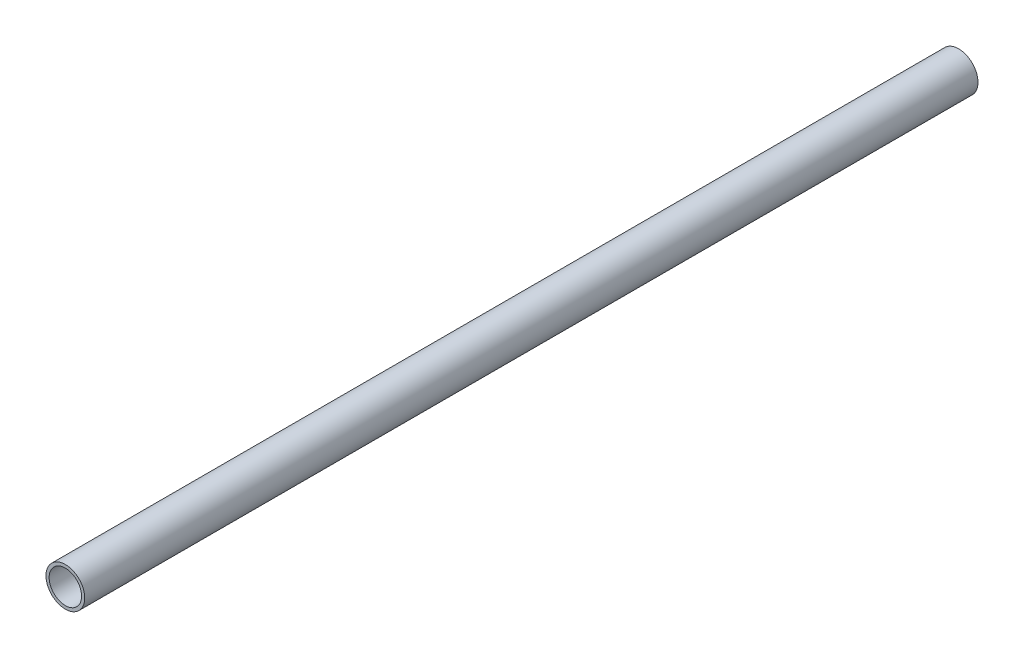
ISO-10303-21;
HEADER;
FILE_DESCRIPTION(('STEP AP214'),'2;1');
FILE_NAME('part.step','',(''),(''),'','','');
FILE_SCHEMA(('AUTOMOTIVE_DESIGN { 1 0 10303 214 1 1 1 1 }'));
ENDSEC;
DATA;
#1=APPLICATION_CONTEXT('core data for automotive mechanical design processes');
#2=APPLICATION_PROTOCOL_DEFINITION('international standard','automotive_design',2000,#1);
#3=PRODUCT_CONTEXT('',#1,'mechanical');
#4=PRODUCT('Part','Part','',(#3));
#5=PRODUCT_RELATED_PRODUCT_CATEGORY('part','',(#4));
#6=PRODUCT_DEFINITION_FORMATION('','',#4);
#7=PRODUCT_DEFINITION_CONTEXT('part definition',#1,'design');
#8=PRODUCT_DEFINITION('design','',#6,#7);
#9=PRODUCT_DEFINITION_SHAPE('','',#8);
#10=(LENGTH_UNIT() NAMED_UNIT(*) SI_UNIT(.MILLI.,.METRE.));
#11=(NAMED_UNIT(*) PLANE_ANGLE_UNIT() SI_UNIT($,.RADIAN.));
#12=(NAMED_UNIT(*) SI_UNIT($,.STERADIAN.) SOLID_ANGLE_UNIT());
#13=UNCERTAINTY_MEASURE_WITH_UNIT(LENGTH_MEASURE(1.E-05),#10,'distance_accuracy_value','');
#14=(GEOMETRIC_REPRESENTATION_CONTEXT(3) GLOBAL_UNCERTAINTY_ASSIGNED_CONTEXT((#13)) GLOBAL_UNIT_ASSIGNED_CONTEXT((#10,
#11,#12)) REPRESENTATION_CONTEXT('',''));
#15=CARTESIAN_POINT('',(0.,0.,0.));
#16=DIRECTION('',(0.,0.,1.));
#17=DIRECTION('',(1.,0.,0.));
#18=AXIS2_PLACEMENT_3D('',#15,#16,#17);
#19=CARTESIAN_POINT('',(0.,0.,-1.));
#20=DIRECTION('',(0.,0.,1.));
#21=DIRECTION('',(1.,0.,0.));
#22=AXIS2_PLACEMENT_3D('',#19,#20,#21);
#23=CYLINDRICAL_SURFACE('',#22,8.35);
#24=CARTESIAN_POINT('',(0.,0.,-1.));
#25=DIRECTION('',(0.,0.,1.));
#26=DIRECTION('',(1.,0.,0.));
#27=AXIS2_PLACEMENT_3D('',#24,#25,#26);
#28=CIRCLE('',#27,8.35);
#29=CARTESIAN_POINT('',(8.35,0.,-1.));
#30=VERTEX_POINT('',#29);
#31=EDGE_CURVE('E10',#30,#30,#28,.T.);
#32=ORIENTED_EDGE('',*,*,#31,.T.);
#33=EDGE_LOOP('',(#32));
#34=FACE_BOUND('',#33,.T.);
#35=CARTESIAN_POINT('',(0.,0.,384.125253593109));
#36=DIRECTION('',(0.,0.,1.));
#37=DIRECTION('',(0.,-1.,0.));
#38=AXIS2_PLACEMENT_3D('',#35,#36,#37);
#39=CIRCLE('',#38,8.35);
#40=CARTESIAN_POINT('',(0.,-8.35,384.125253593109));
#41=VERTEX_POINT('',#40);
#42=EDGE_CURVE('E42',#41,#41,#39,.T.);
#43=ORIENTED_EDGE('',*,*,#42,.F.);
#44=EDGE_LOOP('',(#43));
#45=FACE_BOUND('',#44,.T.);
#46=ADVANCED_FACE('F32',(#34,#45),#23,.T.);
#47=CARTESIAN_POINT('',(0.,0.,-1.));
#48=DIRECTION('',(0.,0.,1.));
#49=DIRECTION('',(1.,0.,0.));
#50=AXIS2_PLACEMENT_3D('',#47,#48,#49);
#51=PLANE('',#50);
#52=CARTESIAN_POINT('',(0.,0.,-1.));
#53=DIRECTION('',(0.,0.,1.));
#54=DIRECTION('',(1.,0.,0.));
#55=AXIS2_PLACEMENT_3D('',#52,#53,#54);
#56=CIRCLE('',#55,7.);
#57=CARTESIAN_POINT('',(7.,0.,-1.));
#58=VERTEX_POINT('',#57);
#59=EDGE_CURVE('E38',#58,#58,#56,.T.);
#60=ORIENTED_EDGE('',*,*,#59,.T.);
#61=EDGE_LOOP('',(#60));
#62=FACE_BOUND('',#61,.T.);
#63=ORIENTED_EDGE('',*,*,#31,.F.);
#64=EDGE_LOOP('',(#63));
#65=FACE_BOUND('',#64,.T.);
#66=ADVANCED_FACE('F61',(#62,#65),#51,.F.);
#67=CARTESIAN_POINT('',(0.,0.,-1.));
#68=DIRECTION('',(0.,0.,1.));
#69=DIRECTION('',(1.,0.,0.));
#70=AXIS2_PLACEMENT_3D('',#67,#68,#69);
#71=CYLINDRICAL_SURFACE('',#70,7.);
#72=ORIENTED_EDGE('',*,*,#59,.F.);
#73=EDGE_LOOP('',(#72));
#74=FACE_BOUND('',#73,.T.);
#75=CARTESIAN_POINT('',(0.,0.,384.125253593109));
#76=DIRECTION('',(0.,0.,1.));
#77=DIRECTION('',(0.,-1.,0.));
#78=AXIS2_PLACEMENT_3D('',#75,#76,#77);
#79=CIRCLE('',#78,7.);
#80=CARTESIAN_POINT('',(0.,-7.,384.125253593109));
#81=VERTEX_POINT('',#80);
#82=EDGE_CURVE('E46',#81,#81,#79,.T.);
#83=ORIENTED_EDGE('',*,*,#82,.T.);
#84=EDGE_LOOP('',(#83));
#85=FACE_BOUND('',#84,.T.);
#86=ADVANCED_FACE('F52',(#74,#85),#71,.F.);
#87=CARTESIAN_POINT('',(7.5824907226431,6.50525437176116,384.125253593109));
#88=DIRECTION('',(0.,0.,1.));
#89=DIRECTION('',(-0.952813910619346,0.303555022574605,0.));
#90=AXIS2_PLACEMENT_3D('',#87,#88,#89);
#91=PLANE('',#90);
#92=ORIENTED_EDGE('',*,*,#82,.F.);
#93=EDGE_LOOP('',(#92));
#94=FACE_BOUND('',#93,.T.);
#95=ORIENTED_EDGE('',*,*,#42,.T.);
#96=EDGE_LOOP('',(#95));
#97=FACE_BOUND('',#96,.T.);
#98=ADVANCED_FACE('F54',(#94,#97),#91,.T.);
#99=CLOSED_SHELL('',(#46,#66,#86,#98));
#100=MANIFOLD_SOLID_BREP('B2',#99);
#101=ADVANCED_BREP_SHAPE_REPRESENTATION('',(#18,#100),#14);
#102=SHAPE_DEFINITION_REPRESENTATION(#9,#101);
ENDSEC;
END-ISO-10303-21;
